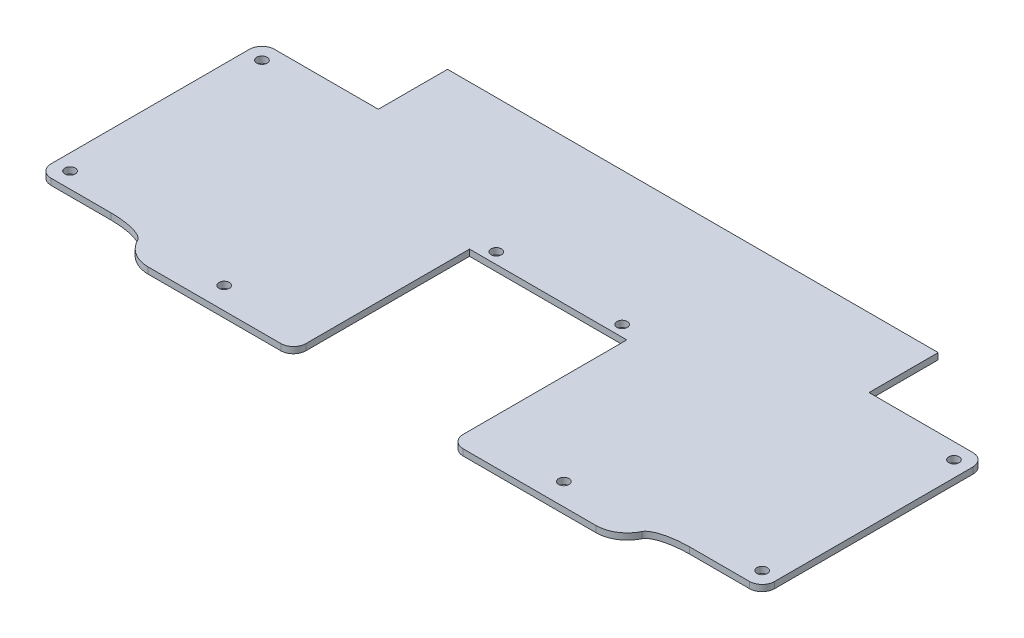
ISO-10303-21;
HEADER;
FILE_DESCRIPTION(('STEP AP214'),'2;1');
FILE_NAME('part.step','',(''),(''),'','','');
FILE_SCHEMA(('AUTOMOTIVE_DESIGN { 1 0 10303 214 1 1 1 1 }'));
ENDSEC;
DATA;
#1=APPLICATION_CONTEXT('core data for automotive mechanical design processes');
#2=APPLICATION_PROTOCOL_DEFINITION('international standard','automotive_design',2000,#1);
#3=PRODUCT_CONTEXT('',#1,'mechanical');
#4=PRODUCT('Part','Part','',(#3));
#5=PRODUCT_RELATED_PRODUCT_CATEGORY('part','',(#4));
#6=PRODUCT_DEFINITION_FORMATION('','',#4);
#7=PRODUCT_DEFINITION_CONTEXT('part definition',#1,'design');
#8=PRODUCT_DEFINITION('design','',#6,#7);
#9=PRODUCT_DEFINITION_SHAPE('','',#8);
#10=(LENGTH_UNIT() NAMED_UNIT(*) SI_UNIT(.MILLI.,.METRE.));
#11=(NAMED_UNIT(*) PLANE_ANGLE_UNIT() SI_UNIT($,.RADIAN.));
#12=(NAMED_UNIT(*) SI_UNIT($,.STERADIAN.) SOLID_ANGLE_UNIT());
#13=UNCERTAINTY_MEASURE_WITH_UNIT(LENGTH_MEASURE(1.E-05),#10,'distance_accuracy_value','');
#14=(GEOMETRIC_REPRESENTATION_CONTEXT(3) GLOBAL_UNCERTAINTY_ASSIGNED_CONTEXT((#13)) GLOBAL_UNIT_ASSIGNED_CONTEXT((#10,
#11,#12)) REPRESENTATION_CONTEXT('',''));
#15=CARTESIAN_POINT('',(0.,0.,0.));
#16=DIRECTION('',(0.,0.,1.));
#17=DIRECTION('',(1.,0.,0.));
#18=AXIS2_PLACEMENT_3D('',#15,#16,#17);
#19=CARTESIAN_POINT('',(0.,2.,0.));
#20=DIRECTION('',(0.,0.,-1.));
#21=DIRECTION('',(-1.,0.,0.));
#22=AXIS2_PLACEMENT_3D('',#19,#20,#21);
#23=PLANE('',#22);
#24=DIRECTION('',(1.,0.,0.));
#25=VECTOR('',#24,1.);
#26=CARTESIAN_POINT('',(0.,2.,0.));
#27=LINE('',#26,#25);
#28=CARTESIAN_POINT('',(43.8448725728949,2.,0.));
#29=VERTEX_POINT('',#28);
#30=CARTESIAN_POINT('',(86.,2.,0.));
#31=VERTEX_POINT('',#30);
#32=EDGE_CURVE('E384',#29,#31,#27,.T.);
#33=ORIENTED_EDGE('',*,*,#32,.F.);
#34=DIRECTION('',(0.,-1.,0.));
#35=VECTOR('',#34,1.);
#36=CARTESIAN_POINT('',(43.8448725728949,2.,0.));
#37=LINE('',#36,#35);
#38=CARTESIAN_POINT('',(43.8448725728949,0.,0.));
#39=VERTEX_POINT('',#38);
#40=EDGE_CURVE('E361',#29,#39,#37,.T.);
#41=ORIENTED_EDGE('',*,*,#40,.T.);
#42=DIRECTION('',(1.,0.,0.));
#43=VECTOR('',#42,1.);
#44=CARTESIAN_POINT('',(0.,0.,0.));
#45=LINE('',#44,#43);
#46=CARTESIAN_POINT('',(86.,0.,0.));
#47=VERTEX_POINT('',#46);
#48=EDGE_CURVE('E404',#39,#47,#45,.T.);
#49=ORIENTED_EDGE('',*,*,#48,.T.);
#50=DIRECTION('',(0.,1.,0.));
#51=VECTOR('',#50,1.);
#52=CARTESIAN_POINT('',(86.,2.,0.));
#53=LINE('',#52,#51);
#54=EDGE_CURVE('E398',#47,#31,#53,.T.);
#55=ORIENTED_EDGE('',*,*,#54,.T.);
#56=EDGE_LOOP('',(#33,#41,#49,#55));
#57=FACE_BOUND('',#56,.T.);
#58=ADVANCED_FACE('F45',(#57),#23,.F.);
#59=CARTESIAN_POINT('',(0.,2.,0.));
#60=DIRECTION('',(1.,0.,0.));
#61=DIRECTION('',(0.,0.,-1.));
#62=AXIS2_PLACEMENT_3D('',#59,#60,#61);
#63=PLANE('',#62);
#64=DIRECTION('',(0.,0.,1.));
#65=VECTOR('',#64,1.);
#66=CARTESIAN_POINT('',(0.,0.,0.));
#67=LINE('',#66,#65);
#68=CARTESIAN_POINT('',(0.,0.,-76.));
#69=VERTEX_POINT('',#68);
#70=CARTESIAN_POINT('',(0.,0.,-13.));
#71=VERTEX_POINT('',#70);
#72=EDGE_CURVE('E399',#69,#71,#67,.T.);
#73=ORIENTED_EDGE('',*,*,#72,.T.);
#74=DIRECTION('',(0.,1.,0.));
#75=VECTOR('',#74,1.);
#76=CARTESIAN_POINT('',(0.,2.,-13.));
#77=LINE('',#76,#75);
#78=CARTESIAN_POINT('',(0.,2.,-13.));
#79=VERTEX_POINT('',#78);
#80=EDGE_CURVE('E454',#71,#79,#77,.T.);
#81=ORIENTED_EDGE('',*,*,#80,.T.);
#82=DIRECTION('',(0.,0.,1.));
#83=VECTOR('',#82,1.);
#84=CARTESIAN_POINT('',(0.,2.,0.));
#85=LINE('',#84,#83);
#86=CARTESIAN_POINT('',(0.,2.,-76.));
#87=VERTEX_POINT('',#86);
#88=EDGE_CURVE('E385',#87,#79,#85,.T.);
#89=ORIENTED_EDGE('',*,*,#88,.F.);
#90=DIRECTION('',(0.,1.,0.));
#91=VECTOR('',#90,1.);
#92=CARTESIAN_POINT('',(0.,2.,-76.));
#93=LINE('',#92,#91);
#94=EDGE_CURVE('E452',#87,#69,#93,.F.);
#95=ORIENTED_EDGE('',*,*,#94,.T.);
#96=EDGE_LOOP('',(#73,#81,#89,#95));
#97=FACE_BOUND('',#96,.T.);
#98=ADVANCED_FACE('F556',(#97),#63,.F.);
#99=CARTESIAN_POINT('',(144.,0.,0.));
#100=VERTEX_POINT('',#99);
#101=CARTESIAN_POINT('',(186.155127427105,0.,0.));
#102=VERTEX_POINT('',#101);
#103=EDGE_CURVE('E380',#100,#102,#45,.T.);
#104=ORIENTED_EDGE('',*,*,#103,.T.);
#105=DIRECTION('',(0.,-1.,0.));
#106=VECTOR('',#105,1.);
#107=CARTESIAN_POINT('',(186.155127427105,2.,0.));
#108=LINE('',#107,#106);
#109=CARTESIAN_POINT('',(186.155127427105,2.,0.));
#110=VERTEX_POINT('',#109);
#111=EDGE_CURVE('E54',#102,#110,#108,.F.);
#112=ORIENTED_EDGE('',*,*,#111,.T.);
#113=CARTESIAN_POINT('',(144.,2.,0.));
#114=VERTEX_POINT('',#113);
#115=EDGE_CURVE('E378',#114,#110,#27,.T.);
#116=ORIENTED_EDGE('',*,*,#115,.F.);
#117=DIRECTION('',(0.,1.,0.));
#118=VECTOR('',#117,1.);
#119=CARTESIAN_POINT('',(144.,2.,0.));
#120=LINE('',#119,#118);
#121=EDGE_CURVE('E440',#114,#100,#120,.F.);
#122=ORIENTED_EDGE('',*,*,#121,.T.);
#123=EDGE_LOOP('',(#104,#112,#116,#122));
#124=FACE_BOUND('',#123,.T.);
#125=ADVANCED_FACE('F377',(#124),#23,.F.);
#126=CARTESIAN_POINT('',(230.,2.,0.));
#127=DIRECTION('',(-1.,0.,0.));
#128=DIRECTION('',(0.,0.,1.));
#129=AXIS2_PLACEMENT_3D('',#126,#127,#128);
#130=PLANE('',#129);
#131=DIRECTION('',(0.,0.,-1.));
#132=VECTOR('',#131,1.);
#133=CARTESIAN_POINT('',(230.,2.,0.));
#134=LINE('',#133,#132);
#135=CARTESIAN_POINT('',(230.,2.,-13.));
#136=VERTEX_POINT('',#135);
#137=CARTESIAN_POINT('',(230.,2.,-76.));
#138=VERTEX_POINT('',#137);
#139=EDGE_CURVE('E387',#136,#138,#134,.T.);
#140=ORIENTED_EDGE('',*,*,#139,.F.);
#141=DIRECTION('',(0.,1.,0.));
#142=VECTOR('',#141,1.);
#143=CARTESIAN_POINT('',(230.,2.,-13.));
#144=LINE('',#143,#142);
#145=CARTESIAN_POINT('',(230.,0.,-13.));
#146=VERTEX_POINT('',#145);
#147=EDGE_CURVE('E448',#136,#146,#144,.F.);
#148=ORIENTED_EDGE('',*,*,#147,.T.);
#149=DIRECTION('',(0.,0.,-1.));
#150=VECTOR('',#149,1.);
#151=CARTESIAN_POINT('',(230.,0.,0.));
#152=LINE('',#151,#150);
#153=CARTESIAN_POINT('',(230.,0.,-76.));
#154=VERTEX_POINT('',#153);
#155=EDGE_CURVE('E405',#146,#154,#152,.T.);
#156=ORIENTED_EDGE('',*,*,#155,.T.);
#157=DIRECTION('',(0.,1.,0.));
#158=VECTOR('',#157,1.);
#159=CARTESIAN_POINT('',(230.,2.,-76.));
#160=LINE('',#159,#158);
#161=EDGE_CURVE('E445',#154,#138,#160,.T.);
#162=ORIENTED_EDGE('',*,*,#161,.T.);
#163=EDGE_LOOP('',(#140,#148,#156,#162));
#164=FACE_BOUND('',#163,.T.);
#165=ADVANCED_FACE('F567',(#164),#130,.F.);
#166=CARTESIAN_POINT('',(0.,2.,-102.));
#167=DIRECTION('',(0.,0.,1.));
#168=DIRECTION('',(1.,0.,0.));
#169=AXIS2_PLACEMENT_3D('',#166,#167,#168);
#170=PLANE('',#169);
#171=DIRECTION('',(-1.,0.,0.));
#172=VECTOR('',#171,1.);
#173=CARTESIAN_POINT('',(0.,2.,-102.));
#174=LINE('',#173,#172);
#175=CARTESIAN_POINT('',(193.,2.,-102.));
#176=VERTEX_POINT('',#175);
#177=CARTESIAN_POINT('',(37.,2.,-102.));
#178=VERTEX_POINT('',#177);
#179=EDGE_CURVE('E395',#176,#178,#174,.T.);
#180=ORIENTED_EDGE('',*,*,#179,.F.);
#181=DIRECTION('',(0.,1.,0.));
#182=VECTOR('',#181,1.);
#183=CARTESIAN_POINT('',(193.,0.,-102.));
#184=LINE('',#183,#182);
#185=CARTESIAN_POINT('',(193.,0.,-102.));
#186=VERTEX_POINT('',#185);
#187=EDGE_CURVE('E687',#186,#176,#184,.T.);
#188=ORIENTED_EDGE('',*,*,#187,.F.);
#189=DIRECTION('',(-1.,0.,0.));
#190=VECTOR('',#189,1.);
#191=CARTESIAN_POINT('',(0.,0.,-102.));
#192=LINE('',#191,#190);
#193=CARTESIAN_POINT('',(37.,0.,-102.));
#194=VERTEX_POINT('',#193);
#195=EDGE_CURVE('E389',#186,#194,#192,.T.);
#196=ORIENTED_EDGE('',*,*,#195,.T.);
#197=DIRECTION('',(0.,1.,0.));
#198=VECTOR('',#197,1.);
#199=CARTESIAN_POINT('',(37.,0.,-102.));
#200=LINE('',#199,#198);
#201=EDGE_CURVE('E402',#194,#178,#200,.T.);
#202=ORIENTED_EDGE('',*,*,#201,.T.);
#203=EDGE_LOOP('',(#180,#188,#196,#202));
#204=FACE_BOUND('',#203,.T.);
#205=ADVANCED_FACE('F303',(#204),#170,.F.);
#206=CARTESIAN_POINT('',(0.,2.,0.));
#207=DIRECTION('',(0.,-1.,0.));
#208=DIRECTION('',(0.,0.,-1.));
#209=AXIS2_PLACEMENT_3D('',#206,#207,#208);
#210=PLANE('',#209);
#211=CARTESIAN_POINT('',(61.,2.,-7.));
#212=DIRECTION('',(0.,-1.,0.));
#213=DIRECTION('',(0.,0.,-1.));
#214=AXIS2_PLACEMENT_3D('',#211,#212,#213);
#215=CIRCLE('',#214,1.65);
#216=CARTESIAN_POINT('',(61.,2.,-8.65));
#217=VERTEX_POINT('',#216);
#218=EDGE_CURVE('E509',#217,#217,#215,.T.);
#219=ORIENTED_EDGE('',*,*,#218,.T.);
#220=EDGE_LOOP('',(#219));
#221=FACE_BOUND('',#220,.T.);
#222=CARTESIAN_POINT('',(169.,2.,-7.00000000000005));
#223=DIRECTION('',(0.,-1.,0.));
#224=DIRECTION('',(0.,0.,-1.));
#225=AXIS2_PLACEMENT_3D('',#222,#223,#224);
#226=CIRCLE('',#225,1.64999999999999);
#227=CARTESIAN_POINT('',(169.,2.,-8.65000000000004));
#228=VERTEX_POINT('',#227);
#229=EDGE_CURVE('E512',#228,#228,#226,.T.);
#230=ORIENTED_EDGE('',*,*,#229,.T.);
#231=EDGE_LOOP('',(#230));
#232=FACE_BOUND('',#231,.T.);
#233=CARTESIAN_POINT('',(5.,2.,-75.));
#234=DIRECTION('',(0.,-1.,0.));
#235=DIRECTION('',(0.,0.,-1.));
#236=AXIS2_PLACEMENT_3D('',#233,#234,#235);
#237=CIRCLE('',#236,1.65);
#238=CARTESIAN_POINT('',(5.,2.,-76.65));
#239=VERTEX_POINT('',#238);
#240=EDGE_CURVE('E242',#239,#239,#237,.T.);
#241=ORIENTED_EDGE('',*,*,#240,.T.);
#242=EDGE_LOOP('',(#241));
#243=FACE_BOUND('',#242,.T.);
#244=CARTESIAN_POINT('',(95.,2.,-59.5));
#245=DIRECTION('',(0.,-1.,0.));
#246=DIRECTION('',(0.,0.,-1.));
#247=AXIS2_PLACEMENT_3D('',#244,#245,#246);
#248=CIRCLE('',#247,1.65);
#249=CARTESIAN_POINT('',(95.,2.,-61.15));
#250=VERTEX_POINT('',#249);
#251=EDGE_CURVE('E476',#250,#250,#248,.T.);
#252=ORIENTED_EDGE('',*,*,#251,.T.);
#253=EDGE_LOOP('',(#252));
#254=FACE_BOUND('',#253,.T.);
#255=CARTESIAN_POINT('',(135.,2.,-59.5));
#256=DIRECTION('',(0.,-1.,0.));
#257=DIRECTION('',(0.,0.,-1.));
#258=AXIS2_PLACEMENT_3D('',#255,#256,#257);
#259=CIRCLE('',#258,1.65000000000002);
#260=CARTESIAN_POINT('',(135.,2.,-61.15));
#261=VERTEX_POINT('',#260);
#262=EDGE_CURVE('E479',#261,#261,#259,.T.);
#263=ORIENTED_EDGE('',*,*,#262,.T.);
#264=EDGE_LOOP('',(#263));
#265=FACE_BOUND('',#264,.T.);
#266=CARTESIAN_POINT('',(225.,2.,-14.0000000000001));
#267=DIRECTION('',(0.,-1.,0.));
#268=DIRECTION('',(0.,0.,-1.));
#269=AXIS2_PLACEMENT_3D('',#266,#267,#268);
#270=CIRCLE('',#269,1.65000000000002);
#271=CARTESIAN_POINT('',(225.,2.,-15.6500000000001));
#272=VERTEX_POINT('',#271);
#273=EDGE_CURVE('E482',#272,#272,#270,.T.);
#274=ORIENTED_EDGE('',*,*,#273,.T.);
#275=EDGE_LOOP('',(#274));
#276=FACE_BOUND('',#275,.T.);
#277=CARTESIAN_POINT('',(225.,2.,-75.0000000000001));
#278=DIRECTION('',(0.,-1.,0.));
#279=DIRECTION('',(0.,0.,-1.));
#280=AXIS2_PLACEMENT_3D('',#277,#278,#279);
#281=CIRCLE('',#280,1.65000000000002);
#282=CARTESIAN_POINT('',(225.,2.,-76.6500000000001));
#283=VERTEX_POINT('',#282);
#284=EDGE_CURVE('E485',#283,#283,#281,.T.);
#285=ORIENTED_EDGE('',*,*,#284,.T.);
#286=EDGE_LOOP('',(#285));
#287=FACE_BOUND('',#286,.T.);
#288=CARTESIAN_POINT('',(5.,2.,-14.));
#289=DIRECTION('',(0.,-1.,0.));
#290=DIRECTION('',(0.,0.,-1.));
#291=AXIS2_PLACEMENT_3D('',#288,#289,#290);
#292=CIRCLE('',#291,1.65);
#293=CARTESIAN_POINT('',(5.,2.,-15.65));
#294=VERTEX_POINT('',#293);
#295=EDGE_CURVE('E488',#294,#294,#292,.T.);
#296=ORIENTED_EDGE('',*,*,#295,.T.);
#297=EDGE_LOOP('',(#296));
#298=FACE_BOUND('',#297,.T.);
#299=CARTESIAN_POINT('',(35.,2.,-5.));
#300=CARTESIAN_POINT('',(35.,2.,-9.));
#301=CARTESIAN_POINT('',(23.,2.,-8.99999999999999));
#302=(BOUNDED_CURVE() B_SPLINE_CURVE(2,(#299,#300,#301),.UNSPECIFIED.,.F.,
.F.) B_SPLINE_CURVE_WITH_KNOTS((3,3),(0.,1.),
.UNSPECIFIED.) CURVE() GEOMETRIC_REPRESENTATION_ITEM() RATIONAL_B_SPLINE_CURVE((1.,
0.707106781186548,1.)) REPRESENTATION_ITEM(''));
#303=CARTESIAN_POINT('',(23.,2.,-9.));
#304=VERTEX_POINT('',#303);
#305=CARTESIAN_POINT('',(34.8470220761661,2.,-5.6383692535883));
#306=VERTEX_POINT('',#305);
#307=EDGE_CURVE('E668',#304,#306,#302,.F.);
#308=ORIENTED_EDGE('',*,*,#307,.T.);
#309=CARTESIAN_POINT('',(43.8448725728949,2.,-10.));
#310=DIRECTION('',(0.,-1.,0.));
#311=DIRECTION('',(0.,0.,-1.));
#312=AXIS2_PLACEMENT_3D('',#309,#310,#311);
#313=CIRCLE('',#312,10.);
#314=EDGE_CURVE('E357',#306,#29,#313,.F.);
#315=ORIENTED_EDGE('',*,*,#314,.T.);
#316=ORIENTED_EDGE('',*,*,#32,.T.);
#317=CARTESIAN_POINT('',(86.,2.,-4.));
#318=DIRECTION('',(0.,-1.,0.));
#319=DIRECTION('',(0.,0.,-1.));
#320=AXIS2_PLACEMENT_3D('',#317,#318,#319);
#321=CIRCLE('',#320,4.);
#322=CARTESIAN_POINT('',(90.,2.,-4.));
#323=VERTEX_POINT('',#322);
#324=EDGE_CURVE('E422',#31,#323,#321,.F.);
#325=ORIENTED_EDGE('',*,*,#324,.T.);
#326=DIRECTION('',(0.,0.,1.));
#327=VECTOR('',#326,1.);
#328=CARTESIAN_POINT('',(90.,2.,0.));
#329=LINE('',#328,#327);
#330=CARTESIAN_POINT('',(90.,2.,-56.));
#331=VERTEX_POINT('',#330);
#332=EDGE_CURVE('E239',#331,#323,#329,.T.);
#333=ORIENTED_EDGE('',*,*,#332,.F.);
#334=DIRECTION('',(-1.,0.,0.));
#335=VECTOR('',#334,1.);
#336=CARTESIAN_POINT('',(90.,2.,-56.));
#337=LINE('',#336,#335);
#338=CARTESIAN_POINT('',(140.,2.,-56.));
#339=VERTEX_POINT('',#338);
#340=EDGE_CURVE('E216',#339,#331,#337,.T.);
#341=ORIENTED_EDGE('',*,*,#340,.F.);
#342=DIRECTION('',(0.,0.,-1.));
#343=VECTOR('',#342,1.);
#344=CARTESIAN_POINT('',(140.,2.,0.));
#345=LINE('',#344,#343);
#346=CARTESIAN_POINT('',(140.,2.,-4.));
#347=VERTEX_POINT('',#346);
#348=EDGE_CURVE('E241',#347,#339,#345,.T.);
#349=ORIENTED_EDGE('',*,*,#348,.F.);
#350=CARTESIAN_POINT('',(144.,2.,-4.));
#351=DIRECTION('',(0.,-1.,0.));
#352=DIRECTION('',(0.,0.,-1.));
#353=AXIS2_PLACEMENT_3D('',#350,#351,#352);
#354=CIRCLE('',#353,4.);
#355=EDGE_CURVE('E383',#347,#114,#354,.F.);
#356=ORIENTED_EDGE('',*,*,#355,.T.);
#357=ORIENTED_EDGE('',*,*,#115,.T.);
#358=CARTESIAN_POINT('',(186.155127427105,2.,-10.));
#359=DIRECTION('',(0.,-1.,0.));
#360=DIRECTION('',(0.,0.,-1.));
#361=AXIS2_PLACEMENT_3D('',#358,#359,#360);
#362=CIRCLE('',#361,10.);
#363=CARTESIAN_POINT('',(195.152965945005,2.,-5.63837544451744));
#364=VERTEX_POINT('',#363);
#365=EDGE_CURVE('E346',#110,#364,#362,.F.);
#366=ORIENTED_EDGE('',*,*,#365,.T.);
#367=CARTESIAN_POINT('',(207.,2.,-8.99999999999999));
#368=CARTESIAN_POINT('',(195.,2.,-9.00000000000008));
#369=CARTESIAN_POINT('',(195.,2.,-5.));
#370=(BOUNDED_CURVE() B_SPLINE_CURVE(2,(#367,#368,#369),.UNSPECIFIED.,.F.,
.F.) B_SPLINE_CURVE_WITH_KNOTS((3,3),(0.,1.),
.UNSPECIFIED.) CURVE() GEOMETRIC_REPRESENTATION_ITEM() RATIONAL_B_SPLINE_CURVE((1.,
0.707106781186545,1.)) REPRESENTATION_ITEM(''));
#371=CARTESIAN_POINT('',(207.,2.,-9.));
#372=VERTEX_POINT('',#371);
#373=EDGE_CURVE('E352',#364,#372,#370,.F.);
#374=ORIENTED_EDGE('',*,*,#373,.T.);
#375=DIRECTION('',(-1.,0.,0.));
#376=VECTOR('',#375,1.);
#377=CARTESIAN_POINT('',(230.,2.,-9.));
#378=LINE('',#377,#376);
#379=CARTESIAN_POINT('',(226.,2.,-9.));
#380=VERTEX_POINT('',#379);
#381=EDGE_CURVE('E220',#380,#372,#378,.T.);
#382=ORIENTED_EDGE('',*,*,#381,.F.);
#383=CARTESIAN_POINT('',(226.,2.,-13.));
#384=DIRECTION('',(0.,-1.,0.));
#385=DIRECTION('',(0.,0.,-1.));
#386=AXIS2_PLACEMENT_3D('',#383,#384,#385);
#387=CIRCLE('',#386,4.);
#388=EDGE_CURVE('E419',#380,#136,#387,.F.);
#389=ORIENTED_EDGE('',*,*,#388,.T.);
#390=ORIENTED_EDGE('',*,*,#139,.T.);
#391=CARTESIAN_POINT('',(226.,2.,-76.));
#392=DIRECTION('',(0.,-1.,0.));
#393=DIRECTION('',(0.,0.,-1.));
#394=AXIS2_PLACEMENT_3D('',#391,#392,#393);
#395=CIRCLE('',#394,4.);
#396=CARTESIAN_POINT('',(226.,2.,-80.));
#397=VERTEX_POINT('',#396);
#398=EDGE_CURVE('E417',#138,#397,#395,.F.);
#399=ORIENTED_EDGE('',*,*,#398,.T.);
#400=DIRECTION('',(1.,0.,0.));
#401=VECTOR('',#400,1.);
#402=CARTESIAN_POINT('',(230.,2.,-80.));
#403=LINE('',#402,#401);
#404=CARTESIAN_POINT('',(193.,2.,-80.));
#405=VERTEX_POINT('',#404);
#406=EDGE_CURVE('E695',#405,#397,#403,.T.);
#407=ORIENTED_EDGE('',*,*,#406,.F.);
#408=DIRECTION('',(0.,0.,1.));
#409=VECTOR('',#408,1.);
#410=CARTESIAN_POINT('',(193.,2.,-102.));
#411=LINE('',#410,#409);
#412=EDGE_CURVE('E468',#176,#405,#411,.T.);
#413=ORIENTED_EDGE('',*,*,#412,.F.);
#414=ORIENTED_EDGE('',*,*,#179,.T.);
#415=DIRECTION('',(0.,0.,-1.));
#416=VECTOR('',#415,1.);
#417=CARTESIAN_POINT('',(37.,2.,-102.));
#418=LINE('',#417,#416);
#419=CARTESIAN_POINT('',(37.,2.,-80.));
#420=VERTEX_POINT('',#419);
#421=EDGE_CURVE('E701',#420,#178,#418,.T.);
#422=ORIENTED_EDGE('',*,*,#421,.F.);
#423=DIRECTION('',(1.,0.,0.));
#424=VECTOR('',#423,1.);
#425=CARTESIAN_POINT('',(0.,2.,-80.));
#426=LINE('',#425,#424);
#427=CARTESIAN_POINT('',(4.,2.,-80.));
#428=VERTEX_POINT('',#427);
#429=EDGE_CURVE('E253',#428,#420,#426,.T.);
#430=ORIENTED_EDGE('',*,*,#429,.F.);
#431=CARTESIAN_POINT('',(4.,2.,-76.));
#432=DIRECTION('',(0.,-1.,0.));
#433=DIRECTION('',(0.,0.,-1.));
#434=AXIS2_PLACEMENT_3D('',#431,#432,#433);
#435=CIRCLE('',#434,4.);
#436=EDGE_CURVE('E412',#428,#87,#435,.F.);
#437=ORIENTED_EDGE('',*,*,#436,.T.);
#438=ORIENTED_EDGE('',*,*,#88,.T.);
#439=CARTESIAN_POINT('',(4.,2.,-13.));
#440=DIRECTION('',(0.,-1.,0.));
#441=DIRECTION('',(0.,0.,-1.));
#442=AXIS2_PLACEMENT_3D('',#439,#440,#441);
#443=CIRCLE('',#442,4.);
#444=CARTESIAN_POINT('',(4.,2.,-9.));
#445=VERTEX_POINT('',#444);
#446=EDGE_CURVE('E414',#79,#445,#443,.F.);
#447=ORIENTED_EDGE('',*,*,#446,.T.);
#448=DIRECTION('',(-1.,0.,0.));
#449=VECTOR('',#448,1.);
#450=CARTESIAN_POINT('',(0.,2.,-9.));
#451=LINE('',#450,#449);
#452=EDGE_CURVE('E254',#304,#445,#451,.T.);
#453=ORIENTED_EDGE('',*,*,#452,.F.);
#454=EDGE_LOOP('',(#308,#315,#316,#325,#333,#341,#349,#356,#357,#366,#374,#382,#389,#390,#399,
#407,#413,#414,#422,#430,#437,#438,#447,#453));
#455=FACE_BOUND('',#454,.T.);
#456=ADVANCED_FACE('F299',(#221,#232,#243,#254,#265,#276,#287,#298,#455),#210,.F.);
#457=CARTESIAN_POINT('',(0.,0.,0.));
#458=DIRECTION('',(0.,-1.,0.));
#459=DIRECTION('',(0.,0.,-1.));
#460=AXIS2_PLACEMENT_3D('',#457,#458,#459);
#461=PLANE('',#460);
#462=CARTESIAN_POINT('',(61.,0.,-7.));
#463=DIRECTION('',(0.,-1.,0.));
#464=DIRECTION('',(0.,0.,-1.));
#465=AXIS2_PLACEMENT_3D('',#462,#463,#464);
#466=CIRCLE('',#465,1.65);
#467=CARTESIAN_POINT('',(61.,0.,-8.65));
#468=VERTEX_POINT('',#467);
#469=EDGE_CURVE('E515',#468,#468,#466,.T.);
#470=ORIENTED_EDGE('',*,*,#469,.F.);
#471=EDGE_LOOP('',(#470));
#472=FACE_BOUND('',#471,.T.);
#473=CARTESIAN_POINT('',(169.,0.,-7.00000000000005));
#474=DIRECTION('',(0.,-1.,0.));
#475=DIRECTION('',(0.,0.,1.));
#476=AXIS2_PLACEMENT_3D('',#473,#474,#475);
#477=CIRCLE('',#476,1.64999999999999);
#478=CARTESIAN_POINT('',(169.,0.,-5.35000000000006));
#479=VERTEX_POINT('',#478);
#480=EDGE_CURVE('E516',#479,#479,#477,.T.);
#481=ORIENTED_EDGE('',*,*,#480,.F.);
#482=EDGE_LOOP('',(#481));
#483=FACE_BOUND('',#482,.T.);
#484=CARTESIAN_POINT('',(5.,0.,-75.));
#485=DIRECTION('',(0.,-1.,0.));
#486=DIRECTION('',(0.,0.,-1.));
#487=AXIS2_PLACEMENT_3D('',#484,#485,#486);
#488=CIRCLE('',#487,1.65);
#489=CARTESIAN_POINT('',(5.,0.,-76.65));
#490=VERTEX_POINT('',#489);
#491=EDGE_CURVE('E494',#490,#490,#488,.T.);
#492=ORIENTED_EDGE('',*,*,#491,.F.);
#493=EDGE_LOOP('',(#492));
#494=FACE_BOUND('',#493,.T.);
#495=CARTESIAN_POINT('',(95.,0.,-59.5));
#496=DIRECTION('',(0.,-1.,0.));
#497=DIRECTION('',(0.,0.,-1.));
#498=AXIS2_PLACEMENT_3D('',#495,#496,#497);
#499=CIRCLE('',#498,1.65);
#500=CARTESIAN_POINT('',(95.,0.,-61.15));
#501=VERTEX_POINT('',#500);
#502=EDGE_CURVE('E502',#501,#501,#499,.T.);
#503=ORIENTED_EDGE('',*,*,#502,.F.);
#504=EDGE_LOOP('',(#503));
#505=FACE_BOUND('',#504,.T.);
#506=CARTESIAN_POINT('',(135.,0.,-59.5));
#507=DIRECTION('',(0.,-1.,0.));
#508=DIRECTION('',(0.,0.,-1.));
#509=AXIS2_PLACEMENT_3D('',#506,#507,#508);
#510=CIRCLE('',#509,1.65000000000002);
#511=CARTESIAN_POINT('',(135.,0.,-61.15));
#512=VERTEX_POINT('',#511);
#513=EDGE_CURVE('E498',#512,#512,#510,.T.);
#514=ORIENTED_EDGE('',*,*,#513,.F.);
#515=EDGE_LOOP('',(#514));
#516=FACE_BOUND('',#515,.T.);
#517=CARTESIAN_POINT('',(225.,0.,-14.0000000000001));
#518=DIRECTION('',(0.,-1.,0.));
#519=DIRECTION('',(0.,0.,1.));
#520=AXIS2_PLACEMENT_3D('',#517,#518,#519);
#521=CIRCLE('',#520,1.65000000000002);
#522=CARTESIAN_POINT('',(225.,0.,-12.3500000000001));
#523=VERTEX_POINT('',#522);
#524=EDGE_CURVE('E495',#523,#523,#521,.T.);
#525=ORIENTED_EDGE('',*,*,#524,.F.);
#526=EDGE_LOOP('',(#525));
#527=FACE_BOUND('',#526,.T.);
#528=CARTESIAN_POINT('',(225.,0.,-75.0000000000001));
#529=DIRECTION('',(0.,-1.,0.));
#530=DIRECTION('',(0.,0.,1.));
#531=AXIS2_PLACEMENT_3D('',#528,#529,#530);
#532=CIRCLE('',#531,1.65000000000002);
#533=CARTESIAN_POINT('',(225.,0.,-73.3500000000001));
#534=VERTEX_POINT('',#533);
#535=EDGE_CURVE('E499',#534,#534,#532,.T.);
#536=ORIENTED_EDGE('',*,*,#535,.F.);
#537=EDGE_LOOP('',(#536));
#538=FACE_BOUND('',#537,.T.);
#539=CARTESIAN_POINT('',(5.,0.,-14.));
#540=DIRECTION('',(0.,-1.,0.));
#541=DIRECTION('',(0.,0.,-1.));
#542=AXIS2_PLACEMENT_3D('',#539,#540,#541);
#543=CIRCLE('',#542,1.65);
#544=CARTESIAN_POINT('',(5.,0.,-15.65));
#545=VERTEX_POINT('',#544);
#546=EDGE_CURVE('E491',#545,#545,#543,.T.);
#547=ORIENTED_EDGE('',*,*,#546,.F.);
#548=EDGE_LOOP('',(#547));
#549=FACE_BOUND('',#548,.T.);
#550=ORIENTED_EDGE('',*,*,#48,.F.);
#551=CARTESIAN_POINT('',(43.8448725728949,0.,-10.));
#552=DIRECTION('',(0.,-1.,0.));
#553=DIRECTION('',(0.,0.,-1.));
#554=AXIS2_PLACEMENT_3D('',#551,#552,#553);
#555=CIRCLE('',#554,10.);
#556=CARTESIAN_POINT('',(34.8470337198352,0.,-5.6383761364759));
#557=VERTEX_POINT('',#556);
#558=EDGE_CURVE('E366',#39,#557,#555,.T.);
#559=ORIENTED_EDGE('',*,*,#558,.T.);
#560=CARTESIAN_POINT('',(23.,0.,-9.));
#561=CARTESIAN_POINT('',(35.,0.,-9.));
#562=CARTESIAN_POINT('',(35.,0.,-5.));
#563=(BOUNDED_CURVE() B_SPLINE_CURVE(2,(#560,#561,#562),.UNSPECIFIED.,.F.,
.F.) B_SPLINE_CURVE_WITH_KNOTS((3,3),(0.,1.),
.UNSPECIFIED.) CURVE() GEOMETRIC_REPRESENTATION_ITEM() RATIONAL_B_SPLINE_CURVE((1.,
0.707106781186548,1.)) REPRESENTATION_ITEM(''));
#564=CARTESIAN_POINT('',(23.,0.,-9.));
#565=VERTEX_POINT('',#564);
#566=EDGE_CURVE('E336',#557,#565,#563,.F.);
#567=ORIENTED_EDGE('',*,*,#566,.T.);
#568=DIRECTION('',(-1.,0.,0.));
#569=VECTOR('',#568,1.);
#570=CARTESIAN_POINT('',(0.,0.,-9.));
#571=LINE('',#570,#569);
#572=CARTESIAN_POINT('',(4.,0.,-9.));
#573=VERTEX_POINT('',#572);
#574=EDGE_CURVE('E250',#565,#573,#571,.T.);
#575=ORIENTED_EDGE('',*,*,#574,.T.);
#576=CARTESIAN_POINT('',(4.,0.,-13.));
#577=DIRECTION('',(0.,-1.,0.));
#578=DIRECTION('',(0.,0.,-1.));
#579=AXIS2_PLACEMENT_3D('',#576,#577,#578);
#580=CIRCLE('',#579,4.);
#581=EDGE_CURVE('E427',#573,#71,#580,.T.);
#582=ORIENTED_EDGE('',*,*,#581,.T.);
#583=ORIENTED_EDGE('',*,*,#72,.F.);
#584=CARTESIAN_POINT('',(4.,0.,-76.));
#585=DIRECTION('',(0.,-1.,0.));
#586=DIRECTION('',(0.,0.,-1.));
#587=AXIS2_PLACEMENT_3D('',#584,#585,#586);
#588=CIRCLE('',#587,4.);
#589=CARTESIAN_POINT('',(4.,0.,-80.));
#590=VERTEX_POINT('',#589);
#591=EDGE_CURVE('E425',#69,#590,#588,.T.);
#592=ORIENTED_EDGE('',*,*,#591,.T.);
#593=DIRECTION('',(1.,0.,0.));
#594=VECTOR('',#593,1.);
#595=CARTESIAN_POINT('',(0.,0.,-80.));
#596=LINE('',#595,#594);
#597=CARTESIAN_POINT('',(37.,0.,-80.));
#598=VERTEX_POINT('',#597);
#599=EDGE_CURVE('E698',#590,#598,#596,.T.);
#600=ORIENTED_EDGE('',*,*,#599,.T.);
#601=DIRECTION('',(0.,0.,-1.));
#602=VECTOR('',#601,1.);
#603=CARTESIAN_POINT('',(37.,0.,-102.));
#604=LINE('',#603,#602);
#605=EDGE_CURVE('E700',#598,#194,#604,.T.);
#606=ORIENTED_EDGE('',*,*,#605,.T.);
#607=ORIENTED_EDGE('',*,*,#195,.F.);
#608=DIRECTION('',(0.,0.,1.));
#609=VECTOR('',#608,1.);
#610=CARTESIAN_POINT('',(193.,0.,-102.));
#611=LINE('',#610,#609);
#612=CARTESIAN_POINT('',(193.,0.,-80.));
#613=VERTEX_POINT('',#612);
#614=EDGE_CURVE('E728',#186,#613,#611,.T.);
#615=ORIENTED_EDGE('',*,*,#614,.T.);
#616=DIRECTION('',(1.,0.,0.));
#617=VECTOR('',#616,1.);
#618=CARTESIAN_POINT('',(230.,0.,-80.));
#619=LINE('',#618,#617);
#620=CARTESIAN_POINT('',(226.,0.,-80.));
#621=VERTEX_POINT('',#620);
#622=EDGE_CURVE('E692',#613,#621,#619,.T.);
#623=ORIENTED_EDGE('',*,*,#622,.T.);
#624=CARTESIAN_POINT('',(226.,0.,-76.));
#625=DIRECTION('',(0.,-1.,0.));
#626=DIRECTION('',(0.,0.,-1.));
#627=AXIS2_PLACEMENT_3D('',#624,#625,#626);
#628=CIRCLE('',#627,4.);
#629=EDGE_CURVE('E429',#621,#154,#628,.T.);
#630=ORIENTED_EDGE('',*,*,#629,.T.);
#631=ORIENTED_EDGE('',*,*,#155,.F.);
#632=CARTESIAN_POINT('',(226.,0.,-13.));
#633=DIRECTION('',(0.,-1.,0.));
#634=DIRECTION('',(0.,0.,-1.));
#635=AXIS2_PLACEMENT_3D('',#632,#633,#634);
#636=CIRCLE('',#635,4.);
#637=CARTESIAN_POINT('',(226.,0.,-9.));
#638=VERTEX_POINT('',#637);
#639=EDGE_CURVE('E431',#146,#638,#636,.T.);
#640=ORIENTED_EDGE('',*,*,#639,.T.);
#641=DIRECTION('',(-1.,0.,0.));
#642=VECTOR('',#641,1.);
#643=CARTESIAN_POINT('',(230.,0.,-9.));
#644=LINE('',#643,#642);
#645=CARTESIAN_POINT('',(207.,0.,-9.));
#646=VERTEX_POINT('',#645);
#647=EDGE_CURVE('E464',#638,#646,#644,.T.);
#648=ORIENTED_EDGE('',*,*,#647,.T.);
#649=CARTESIAN_POINT('',(195.,0.,-5.));
#650=CARTESIAN_POINT('',(195.,0.,-9.00000000000008));
#651=CARTESIAN_POINT('',(207.,0.,-9.));
#652=(BOUNDED_CURVE() B_SPLINE_CURVE(2,(#649,#650,#651),.UNSPECIFIED.,.F.,
.F.) B_SPLINE_CURVE_WITH_KNOTS((3,3),(0.,1.),
.UNSPECIFIED.) CURVE() GEOMETRIC_REPRESENTATION_ITEM() RATIONAL_B_SPLINE_CURVE((1.,
0.707106781186545,1.)) REPRESENTATION_ITEM(''));
#653=CARTESIAN_POINT('',(195.152977923834,0.,-5.63836925358829));
#654=VERTEX_POINT('',#653);
#655=EDGE_CURVE('E684',#646,#654,#652,.F.);
#656=ORIENTED_EDGE('',*,*,#655,.T.);
#657=CARTESIAN_POINT('',(186.155127427105,0.,-10.));
#658=DIRECTION('',(0.,-1.,0.));
#659=DIRECTION('',(0.,0.,-1.));
#660=AXIS2_PLACEMENT_3D('',#657,#658,#659);
#661=CIRCLE('',#660,10.);
#662=EDGE_CURVE('E61',#654,#102,#661,.T.);
#663=ORIENTED_EDGE('',*,*,#662,.T.);
#664=ORIENTED_EDGE('',*,*,#103,.F.);
#665=CARTESIAN_POINT('',(144.,0.,-4.));
#666=DIRECTION('',(0.,-1.,0.));
#667=DIRECTION('',(0.,0.,-1.));
#668=AXIS2_PLACEMENT_3D('',#665,#666,#667);
#669=CIRCLE('',#668,4.);
#670=CARTESIAN_POINT('',(140.,0.,-4.));
#671=VERTEX_POINT('',#670);
#672=EDGE_CURVE('E433',#100,#671,#669,.T.);
#673=ORIENTED_EDGE('',*,*,#672,.T.);
#674=DIRECTION('',(0.,0.,-1.));
#675=VECTOR('',#674,1.);
#676=CARTESIAN_POINT('',(140.,0.,0.));
#677=LINE('',#676,#675);
#678=CARTESIAN_POINT('',(140.,0.,-56.));
#679=VERTEX_POINT('',#678);
#680=EDGE_CURVE('E230',#671,#679,#677,.T.);
#681=ORIENTED_EDGE('',*,*,#680,.T.);
#682=DIRECTION('',(-1.,0.,0.));
#683=VECTOR('',#682,1.);
#684=CARTESIAN_POINT('',(90.,0.,-56.));
#685=LINE('',#684,#683);
#686=CARTESIAN_POINT('',(90.,0.,-56.));
#687=VERTEX_POINT('',#686);
#688=EDGE_CURVE('E213',#679,#687,#685,.T.);
#689=ORIENTED_EDGE('',*,*,#688,.T.);
#690=DIRECTION('',(0.,0.,1.));
#691=VECTOR('',#690,1.);
#692=CARTESIAN_POINT('',(90.,0.,0.));
#693=LINE('',#692,#691);
#694=CARTESIAN_POINT('',(90.,0.,-4.));
#695=VERTEX_POINT('',#694);
#696=EDGE_CURVE('E224',#687,#695,#693,.T.);
#697=ORIENTED_EDGE('',*,*,#696,.T.);
#698=CARTESIAN_POINT('',(86.,0.,-4.));
#699=DIRECTION('',(0.,-1.,0.));
#700=DIRECTION('',(0.,0.,-1.));
#701=AXIS2_PLACEMENT_3D('',#698,#699,#700);
#702=CIRCLE('',#701,4.);
#703=EDGE_CURVE('E435',#695,#47,#702,.T.);
#704=ORIENTED_EDGE('',*,*,#703,.T.);
#705=EDGE_LOOP('',(#550,#559,#567,#575,#582,#583,#592,#600,#606,#607,#615,#623,#630,#631,#640,
#648,#656,#663,#664,#673,#681,#689,#697,#704));
#706=FACE_BOUND('',#705,.T.);
#707=ADVANCED_FACE('F233',(#472,#483,#494,#505,#516,#527,#538,#549,#706),#461,.T.);
#708=CARTESIAN_POINT('',(37.,0.,-102.));
#709=DIRECTION('',(1.,0.,0.));
#710=DIRECTION('',(0.,0.,-1.));
#711=AXIS2_PLACEMENT_3D('',#708,#709,#710);
#712=PLANE('',#711);
#713=ORIENTED_EDGE('',*,*,#421,.T.);
#714=ORIENTED_EDGE('',*,*,#201,.F.);
#715=ORIENTED_EDGE('',*,*,#605,.F.);
#716=DIRECTION('',(0.,1.,0.));
#717=VECTOR('',#716,1.);
#718=CARTESIAN_POINT('',(37.,0.,-80.));
#719=LINE('',#718,#717);
#720=EDGE_CURVE('E704',#598,#420,#719,.T.);
#721=ORIENTED_EDGE('',*,*,#720,.T.);
#722=EDGE_LOOP('',(#713,#714,#715,#721));
#723=FACE_BOUND('',#722,.T.);
#724=ADVANCED_FACE('F292',(#723),#712,.F.);
#725=CARTESIAN_POINT('',(0.,0.,-80.));
#726=DIRECTION('',(0.,0.,1.));
#727=DIRECTION('',(1.,0.,0.));
#728=AXIS2_PLACEMENT_3D('',#725,#726,#727);
#729=PLANE('',#728);
#730=ORIENTED_EDGE('',*,*,#599,.F.);
#731=DIRECTION('',(0.,1.,0.));
#732=VECTOR('',#731,1.);
#733=CARTESIAN_POINT('',(4.,0.,-80.));
#734=LINE('',#733,#732);
#735=EDGE_CURVE('E460',#590,#428,#734,.T.);
#736=ORIENTED_EDGE('',*,*,#735,.T.);
#737=ORIENTED_EDGE('',*,*,#429,.T.);
#738=ORIENTED_EDGE('',*,*,#720,.F.);
#739=EDGE_LOOP('',(#730,#736,#737,#738));
#740=FACE_BOUND('',#739,.T.);
#741=ADVANCED_FACE('F295',(#740),#729,.F.);
#742=CARTESIAN_POINT('',(90.,0.,0.));
#743=DIRECTION('',(-1.,0.,0.));
#744=DIRECTION('',(0.,0.,1.));
#745=AXIS2_PLACEMENT_3D('',#742,#743,#744);
#746=PLANE('',#745);
#747=ORIENTED_EDGE('',*,*,#332,.T.);
#748=DIRECTION('',(0.,1.,0.));
#749=VECTOR('',#748,1.);
#750=CARTESIAN_POINT('',(90.,0.,-4.));
#751=LINE('',#750,#749);
#752=EDGE_CURVE('E227',#323,#695,#751,.F.);
#753=ORIENTED_EDGE('',*,*,#752,.T.);
#754=ORIENTED_EDGE('',*,*,#696,.F.);
#755=DIRECTION('',(0.,1.,0.));
#756=VECTOR('',#755,1.);
#757=CARTESIAN_POINT('',(90.,0.,-56.));
#758=LINE('',#757,#756);
#759=EDGE_CURVE('E208',#687,#331,#758,.T.);
#760=ORIENTED_EDGE('',*,*,#759,.T.);
#761=EDGE_LOOP('',(#747,#753,#754,#760));
#762=FACE_BOUND('',#761,.T.);
#763=ADVANCED_FACE('F225',(#762),#746,.F.);
#764=CARTESIAN_POINT('',(90.,0.,-56.));
#765=DIRECTION('',(0.,0.,-1.));
#766=DIRECTION('',(-1.,0.,0.));
#767=AXIS2_PLACEMENT_3D('',#764,#765,#766);
#768=PLANE('',#767);
#769=ORIENTED_EDGE('',*,*,#340,.T.);
#770=ORIENTED_EDGE('',*,*,#759,.F.);
#771=ORIENTED_EDGE('',*,*,#688,.F.);
#772=DIRECTION('',(0.,1.,0.));
#773=VECTOR('',#772,1.);
#774=CARTESIAN_POINT('',(140.,0.,-56.));
#775=LINE('',#774,#773);
#776=EDGE_CURVE('E221',#679,#339,#775,.T.);
#777=ORIENTED_EDGE('',*,*,#776,.T.);
#778=EDGE_LOOP('',(#769,#770,#771,#777));
#779=FACE_BOUND('',#778,.T.);
#780=ADVANCED_FACE('F210',(#779),#768,.F.);
#781=CARTESIAN_POINT('',(140.,0.,0.));
#782=DIRECTION('',(1.,0.,0.));
#783=DIRECTION('',(0.,0.,-1.));
#784=AXIS2_PLACEMENT_3D('',#781,#782,#783);
#785=PLANE('',#784);
#786=ORIENTED_EDGE('',*,*,#680,.F.);
#787=DIRECTION('',(0.,1.,0.));
#788=VECTOR('',#787,1.);
#789=CARTESIAN_POINT('',(140.,0.,-4.));
#790=LINE('',#789,#788);
#791=EDGE_CURVE('E437',#671,#347,#790,.T.);
#792=ORIENTED_EDGE('',*,*,#791,.T.);
#793=ORIENTED_EDGE('',*,*,#348,.T.);
#794=ORIENTED_EDGE('',*,*,#776,.F.);
#795=EDGE_LOOP('',(#786,#792,#793,#794));
#796=FACE_BOUND('',#795,.T.);
#797=ADVANCED_FACE('F597',(#796),#785,.F.);
#798=CARTESIAN_POINT('',(230.,0.,-9.));
#799=DIRECTION('',(0.,0.,-1.));
#800=DIRECTION('',(-1.,0.,0.));
#801=AXIS2_PLACEMENT_3D('',#798,#799,#800);
#802=PLANE('',#801);
#803=ORIENTED_EDGE('',*,*,#381,.T.);
#804=CARTESIAN_POINT('',(207.,-0.1,-9.));
#805=CARTESIAN_POINT('',(207.,0.633333333333334,-9.));
#806=CARTESIAN_POINT('',(207.,1.36666666666667,-9.));
#807=CARTESIAN_POINT('',(207.,2.1,-9.));
#808=(BOUNDED_CURVE() B_SPLINE_CURVE(3,(#804,#805,#806,#807),.UNSPECIFIED.,.F.,
.F.) B_SPLINE_CURVE_WITH_KNOTS((4,4),(-0.0021,9.99999999999998E-05),
.UNSPECIFIED.) CURVE() GEOMETRIC_REPRESENTATION_ITEM() RATIONAL_B_SPLINE_CURVE((1.,1.,1.,1.)) REPRESENTATION_ITEM(''));
#809=EDGE_CURVE('E463',#372,#646,#808,.F.);
#810=ORIENTED_EDGE('',*,*,#809,.T.);
#811=ORIENTED_EDGE('',*,*,#647,.F.);
#812=DIRECTION('',(0.,1.,0.));
#813=VECTOR('',#812,1.);
#814=CARTESIAN_POINT('',(226.,0.,-9.));
#815=LINE('',#814,#813);
#816=EDGE_CURVE('E442',#638,#380,#815,.T.);
#817=ORIENTED_EDGE('',*,*,#816,.T.);
#818=EDGE_LOOP('',(#803,#810,#811,#817));
#819=FACE_BOUND('',#818,.T.);
#820=ADVANCED_FACE('F287',(#819),#802,.F.);
#821=CARTESIAN_POINT('',(230.,0.,-80.));
#822=DIRECTION('',(0.,0.,1.));
#823=DIRECTION('',(1.,0.,0.));
#824=AXIS2_PLACEMENT_3D('',#821,#822,#823);
#825=PLANE('',#824);
#826=ORIENTED_EDGE('',*,*,#406,.T.);
#827=DIRECTION('',(0.,1.,0.));
#828=VECTOR('',#827,1.);
#829=CARTESIAN_POINT('',(226.,0.,-80.));
#830=LINE('',#829,#828);
#831=EDGE_CURVE('E450',#397,#621,#830,.F.);
#832=ORIENTED_EDGE('',*,*,#831,.T.);
#833=ORIENTED_EDGE('',*,*,#622,.F.);
#834=DIRECTION('',(0.,1.,0.));
#835=VECTOR('',#834,1.);
#836=CARTESIAN_POINT('',(193.,0.,-80.));
#837=LINE('',#836,#835);
#838=EDGE_CURVE('E686',#613,#405,#837,.T.);
#839=ORIENTED_EDGE('',*,*,#838,.T.);
#840=EDGE_LOOP('',(#826,#832,#833,#839));
#841=FACE_BOUND('',#840,.T.);
#842=ADVANCED_FACE('F284',(#841),#825,.F.);
#843=CARTESIAN_POINT('',(193.,0.,-102.));
#844=DIRECTION('',(-1.,0.,0.));
#845=DIRECTION('',(0.,0.,1.));
#846=AXIS2_PLACEMENT_3D('',#843,#844,#845);
#847=PLANE('',#846);
#848=ORIENTED_EDGE('',*,*,#412,.T.);
#849=ORIENTED_EDGE('',*,*,#838,.F.);
#850=ORIENTED_EDGE('',*,*,#614,.F.);
#851=ORIENTED_EDGE('',*,*,#187,.T.);
#852=EDGE_LOOP('',(#848,#849,#850,#851));
#853=FACE_BOUND('',#852,.T.);
#854=ADVANCED_FACE('F282',(#853),#847,.F.);
#855=CARTESIAN_POINT('',(0.,0.,-9.));
#856=DIRECTION('',(0.,0.,-1.));
#857=DIRECTION('',(-1.,0.,0.));
#858=AXIS2_PLACEMENT_3D('',#855,#856,#857);
#859=PLANE('',#858);
#860=ORIENTED_EDGE('',*,*,#574,.F.);
#861=CARTESIAN_POINT('',(23.,2.1,-9.));
#862=CARTESIAN_POINT('',(23.,1.36666666666667,-9.));
#863=CARTESIAN_POINT('',(23.,0.633333333333334,-9.));
#864=CARTESIAN_POINT('',(23.,-0.1,-9.));
#865=(BOUNDED_CURVE() B_SPLINE_CURVE(3,(#861,#862,#863,#864),.UNSPECIFIED.,.F.,
.F.) B_SPLINE_CURVE_WITH_KNOTS((4,4),(-0.0021,0.0001),
.UNSPECIFIED.) CURVE() GEOMETRIC_REPRESENTATION_ITEM() RATIONAL_B_SPLINE_CURVE((1.,1.,1.,1.)) REPRESENTATION_ITEM(''));
#866=EDGE_CURVE('E261',#565,#304,#865,.F.);
#867=ORIENTED_EDGE('',*,*,#866,.T.);
#868=ORIENTED_EDGE('',*,*,#452,.T.);
#869=DIRECTION('',(0.,1.,0.));
#870=VECTOR('',#869,1.);
#871=CARTESIAN_POINT('',(4.,0.,-9.));
#872=LINE('',#871,#870);
#873=EDGE_CURVE('E457',#445,#573,#872,.F.);
#874=ORIENTED_EDGE('',*,*,#873,.T.);
#875=EDGE_LOOP('',(#860,#867,#868,#874));
#876=FACE_BOUND('',#875,.T.);
#877=ADVANCED_FACE('F271',(#876),#859,.F.);
#878=CARTESIAN_POINT('',(5.,10.,-14.));
#879=DIRECTION('',(0.,-1.,0.));
#880=DIRECTION('',(0.,0.,-1.));
#881=AXIS2_PLACEMENT_3D('',#878,#879,#880);
#882=CYLINDRICAL_SURFACE('',#881,1.65);
#883=ORIENTED_EDGE('',*,*,#546,.T.);
#884=EDGE_LOOP('',(#883));
#885=FACE_BOUND('',#884,.T.);
#886=ORIENTED_EDGE('',*,*,#295,.F.);
#887=EDGE_LOOP('',(#886));
#888=FACE_BOUND('',#887,.T.);
#889=ADVANCED_FACE('F281',(#885,#888),#882,.F.);
#890=CARTESIAN_POINT('',(225.,10.,-75.0000000000001));
#891=DIRECTION('',(0.,-1.,0.));
#892=DIRECTION('',(0.,0.,-1.));
#893=AXIS2_PLACEMENT_3D('',#890,#891,#892);
#894=CYLINDRICAL_SURFACE('',#893,1.65000000000002);
#895=ORIENTED_EDGE('',*,*,#535,.T.);
#896=EDGE_LOOP('',(#895));
#897=FACE_BOUND('',#896,.T.);
#898=ORIENTED_EDGE('',*,*,#284,.F.);
#899=EDGE_LOOP('',(#898));
#900=FACE_BOUND('',#899,.T.);
#901=ADVANCED_FACE('F543',(#897,#900),#894,.F.);
#902=CARTESIAN_POINT('',(225.,10.,-14.0000000000001));
#903=DIRECTION('',(0.,-1.,0.));
#904=DIRECTION('',(0.,0.,-1.));
#905=AXIS2_PLACEMENT_3D('',#902,#903,#904);
#906=CYLINDRICAL_SURFACE('',#905,1.65000000000002);
#907=ORIENTED_EDGE('',*,*,#524,.T.);
#908=EDGE_LOOP('',(#907));
#909=FACE_BOUND('',#908,.T.);
#910=ORIENTED_EDGE('',*,*,#273,.F.);
#911=EDGE_LOOP('',(#910));
#912=FACE_BOUND('',#911,.T.);
#913=ADVANCED_FACE('F550',(#909,#912),#906,.F.);
#914=CARTESIAN_POINT('',(135.,10.,-59.5));
#915=DIRECTION('',(0.,-1.,0.));
#916=DIRECTION('',(0.,0.,-1.));
#917=AXIS2_PLACEMENT_3D('',#914,#915,#916);
#918=CYLINDRICAL_SURFACE('',#917,1.65000000000002);
#919=ORIENTED_EDGE('',*,*,#513,.T.);
#920=EDGE_LOOP('',(#919));
#921=FACE_BOUND('',#920,.T.);
#922=ORIENTED_EDGE('',*,*,#262,.F.);
#923=EDGE_LOOP('',(#922));
#924=FACE_BOUND('',#923,.T.);
#925=ADVANCED_FACE('F845',(#921,#924),#918,.F.);
#926=CARTESIAN_POINT('',(95.,10.,-59.5));
#927=DIRECTION('',(0.,-1.,0.));
#928=DIRECTION('',(0.,0.,-1.));
#929=AXIS2_PLACEMENT_3D('',#926,#927,#928);
#930=CYLINDRICAL_SURFACE('',#929,1.65);
#931=ORIENTED_EDGE('',*,*,#502,.T.);
#932=EDGE_LOOP('',(#931));
#933=FACE_BOUND('',#932,.T.);
#934=ORIENTED_EDGE('',*,*,#251,.F.);
#935=EDGE_LOOP('',(#934));
#936=FACE_BOUND('',#935,.T.);
#937=ADVANCED_FACE('F834',(#933,#936),#930,.F.);
#938=CARTESIAN_POINT('',(5.,10.,-75.));
#939=DIRECTION('',(0.,-1.,0.));
#940=DIRECTION('',(0.,0.,-1.));
#941=AXIS2_PLACEMENT_3D('',#938,#939,#940);
#942=CYLINDRICAL_SURFACE('',#941,1.65);
#943=ORIENTED_EDGE('',*,*,#491,.T.);
#944=EDGE_LOOP('',(#943));
#945=FACE_BOUND('',#944,.T.);
#946=ORIENTED_EDGE('',*,*,#240,.F.);
#947=EDGE_LOOP('',(#946));
#948=FACE_BOUND('',#947,.T.);
#949=ADVANCED_FACE('F616',(#945,#948),#942,.F.);
#950=CARTESIAN_POINT('',(86.,2.,-4.));
#951=DIRECTION('',(0.,1.,0.));
#952=DIRECTION('',(0.,0.,1.));
#953=AXIS2_PLACEMENT_3D('',#950,#951,#952);
#954=CYLINDRICAL_SURFACE('',#953,4.);
#955=ORIENTED_EDGE('',*,*,#703,.F.);
#956=ORIENTED_EDGE('',*,*,#752,.F.);
#957=ORIENTED_EDGE('',*,*,#324,.F.);
#958=ORIENTED_EDGE('',*,*,#54,.F.);
#959=EDGE_LOOP('',(#955,#956,#957,#958));
#960=FACE_BOUND('',#959,.T.);
#961=ADVANCED_FACE('F608',(#960),#954,.T.);
#962=CARTESIAN_POINT('',(144.,0.,-4.));
#963=DIRECTION('',(0.,1.,0.));
#964=DIRECTION('',(0.,0.,1.));
#965=AXIS2_PLACEMENT_3D('',#962,#963,#964);
#966=CYLINDRICAL_SURFACE('',#965,4.);
#967=ORIENTED_EDGE('',*,*,#672,.F.);
#968=ORIENTED_EDGE('',*,*,#121,.F.);
#969=ORIENTED_EDGE('',*,*,#355,.F.);
#970=ORIENTED_EDGE('',*,*,#791,.F.);
#971=EDGE_LOOP('',(#967,#968,#969,#970));
#972=FACE_BOUND('',#971,.T.);
#973=ADVANCED_FACE('F606',(#972),#966,.T.);
#974=CARTESIAN_POINT('',(226.,0.,-13.));
#975=DIRECTION('',(0.,1.,0.));
#976=DIRECTION('',(0.,0.,1.));
#977=AXIS2_PLACEMENT_3D('',#974,#975,#976);
#978=CYLINDRICAL_SURFACE('',#977,4.);
#979=ORIENTED_EDGE('',*,*,#639,.F.);
#980=ORIENTED_EDGE('',*,*,#147,.F.);
#981=ORIENTED_EDGE('',*,*,#388,.F.);
#982=ORIENTED_EDGE('',*,*,#816,.F.);
#983=EDGE_LOOP('',(#979,#980,#981,#982));
#984=FACE_BOUND('',#983,.T.);
#985=ADVANCED_FACE('F582',(#984),#978,.T.);
#986=CARTESIAN_POINT('',(226.,2.,-76.));
#987=DIRECTION('',(0.,1.,0.));
#988=DIRECTION('',(0.,0.,1.));
#989=AXIS2_PLACEMENT_3D('',#986,#987,#988);
#990=CYLINDRICAL_SURFACE('',#989,4.);
#991=ORIENTED_EDGE('',*,*,#629,.F.);
#992=ORIENTED_EDGE('',*,*,#831,.F.);
#993=ORIENTED_EDGE('',*,*,#398,.F.);
#994=ORIENTED_EDGE('',*,*,#161,.F.);
#995=EDGE_LOOP('',(#991,#992,#993,#994));
#996=FACE_BOUND('',#995,.T.);
#997=ADVANCED_FACE('F614',(#996),#990,.T.);
#998=CARTESIAN_POINT('',(4.,2.,-13.));
#999=DIRECTION('',(0.,1.,0.));
#1000=DIRECTION('',(0.,0.,1.));
#1001=AXIS2_PLACEMENT_3D('',#998,#999,#1000);
#1002=CYLINDRICAL_SURFACE('',#1001,4.);
#1003=ORIENTED_EDGE('',*,*,#581,.F.);
#1004=ORIENTED_EDGE('',*,*,#873,.F.);
#1005=ORIENTED_EDGE('',*,*,#446,.F.);
#1006=ORIENTED_EDGE('',*,*,#80,.F.);
#1007=EDGE_LOOP('',(#1003,#1004,#1005,#1006));
#1008=FACE_BOUND('',#1007,.T.);
#1009=ADVANCED_FACE('F622',(#1008),#1002,.T.);
#1010=CARTESIAN_POINT('',(4.,0.,-76.));
#1011=DIRECTION('',(0.,1.,0.));
#1012=DIRECTION('',(0.,0.,1.));
#1013=AXIS2_PLACEMENT_3D('',#1010,#1011,#1012);
#1014=CYLINDRICAL_SURFACE('',#1013,4.);
#1015=ORIENTED_EDGE('',*,*,#591,.F.);
#1016=ORIENTED_EDGE('',*,*,#94,.F.);
#1017=ORIENTED_EDGE('',*,*,#436,.F.);
#1018=ORIENTED_EDGE('',*,*,#735,.F.);
#1019=EDGE_LOOP('',(#1015,#1016,#1017,#1018));
#1020=FACE_BOUND('',#1019,.T.);
#1021=ADVANCED_FACE('F626',(#1020),#1014,.T.);
#1022=CARTESIAN_POINT('',(207.,2.1,-9.));
#1023=CARTESIAN_POINT('',(207.,1.36666666666667,-9.));
#1024=CARTESIAN_POINT('',(207.,0.633333333333334,-9.));
#1025=CARTESIAN_POINT('',(207.,-0.1,-9.));
#1026=CARTESIAN_POINT('',(195.,2.1,-9.00000000000008));
#1027=CARTESIAN_POINT('',(195.,1.36666666666667,-9.00000000000008));
#1028=CARTESIAN_POINT('',(195.,0.633333333333334,-9.00000000000008));
#1029=CARTESIAN_POINT('',(195.,-0.1,-9.00000000000008));
#1030=CARTESIAN_POINT('',(195.,2.1,-5.));
#1031=CARTESIAN_POINT('',(195.,1.36666666666667,-5.));
#1032=CARTESIAN_POINT('',(195.,0.633333333333334,-5.));
#1033=CARTESIAN_POINT('',(195.,-0.1,-5.));
#1034=(BOUNDED_SURFACE() B_SPLINE_SURFACE(2,3,((#1022,#1023,#1024,#1025),(#1026,#1027,#1028,
#1029),(#1030,#1031,#1032,#1033)),.UNSPECIFIED.,.F.,.F.,.F.) B_SPLINE_SURFACE_WITH_KNOTS((3,3),
(4,4),(0.,1.),(-0.0021,0.0001),
.UNSPECIFIED.) GEOMETRIC_REPRESENTATION_ITEM() RATIONAL_B_SPLINE_SURFACE(((1.,1.,1.,1.),
(0.707106781186545,0.707106781186545,0.707106781186545,0.707106781186545),(1.,1.,1.,1.))) REPRESENTATION_ITEM('') SURFACE());
#1035=DIRECTION('',(0.,-1.,0.));
#1036=VECTOR('',#1035,1.);
#1037=CARTESIAN_POINT('',(195.153647257195,2.,-5.63804620984235));
#1038=LINE('',#1037,#1036);
#1039=EDGE_CURVE('E12',#364,#654,#1038,.T.);
#1040=ORIENTED_EDGE('',*,*,#373,.F.);
#1041=ORIENTED_EDGE('',*,*,#1039,.T.);
#1042=ORIENTED_EDGE('',*,*,#655,.F.);
#1043=ORIENTED_EDGE('',*,*,#809,.F.);
#1044=EDGE_LOOP('',(#1040,#1041,#1042,#1043));
#1045=FACE_BOUND('',#1044,.T.);
#1046=ADVANCED_FACE('F629',(#1045),#1034,.T.);
#1047=CARTESIAN_POINT('',(35.,2.1,-5.));
#1048=CARTESIAN_POINT('',(35.,1.36666666666667,-5.));
#1049=CARTESIAN_POINT('',(35.,0.633333333333334,-5.));
#1050=CARTESIAN_POINT('',(35.,-0.1,-5.));
#1051=CARTESIAN_POINT('',(35.,2.1,-9.));
#1052=CARTESIAN_POINT('',(35.,1.36666666666667,-9.));
#1053=CARTESIAN_POINT('',(35.,0.633333333333334,-9.));
#1054=CARTESIAN_POINT('',(35.,-0.1,-9.));
#1055=CARTESIAN_POINT('',(23.,2.1,-9.));
#1056=CARTESIAN_POINT('',(23.,1.36666666666667,-9.));
#1057=CARTESIAN_POINT('',(23.,0.633333333333334,-9.));
#1058=CARTESIAN_POINT('',(23.,-0.1,-9.));
#1059=(BOUNDED_SURFACE() B_SPLINE_SURFACE(2,3,((#1047,#1048,#1049,#1050),(#1051,#1052,#1053,
#1054),(#1055,#1056,#1057,#1058)),.UNSPECIFIED.,.F.,.F.,.F.) B_SPLINE_SURFACE_WITH_KNOTS((3,3),
(4,4),(0.,1.),(-0.0021,0.0001),
.UNSPECIFIED.) GEOMETRIC_REPRESENTATION_ITEM() RATIONAL_B_SPLINE_SURFACE(((1.,1.,1.,1.),
(0.707106781186548,0.707106781186548,0.707106781186548,0.707106781186548),(1.,1.,1.,1.))) REPRESENTATION_ITEM('') SURFACE());
#1060=DIRECTION('',(0.,-1.,0.));
#1061=VECTOR('',#1060,1.);
#1062=CARTESIAN_POINT('',(34.8463527428045,0.,-5.63804620984232));
#1063=LINE('',#1062,#1061);
#1064=EDGE_CURVE('E344',#557,#306,#1063,.F.);
#1065=ORIENTED_EDGE('',*,*,#566,.F.);
#1066=ORIENTED_EDGE('',*,*,#1064,.T.);
#1067=ORIENTED_EDGE('',*,*,#307,.F.);
#1068=ORIENTED_EDGE('',*,*,#866,.F.);
#1069=EDGE_LOOP('',(#1065,#1066,#1067,#1068));
#1070=FACE_BOUND('',#1069,.T.);
#1071=ADVANCED_FACE('F639',(#1070),#1059,.T.);
#1072=CARTESIAN_POINT('',(43.8448725728949,1.00000000000001,-10.));
#1073=DIRECTION('',(0.,-1.,0.));
#1074=DIRECTION('',(0.,0.,-1.));
#1075=AXIS2_PLACEMENT_3D('',#1072,#1073,#1074);
#1076=CYLINDRICAL_SURFACE('',#1075,10.);
#1077=ORIENTED_EDGE('',*,*,#558,.F.);
#1078=ORIENTED_EDGE('',*,*,#40,.F.);
#1079=ORIENTED_EDGE('',*,*,#314,.F.);
#1080=ORIENTED_EDGE('',*,*,#1064,.F.);
#1081=EDGE_LOOP('',(#1077,#1078,#1079,#1080));
#1082=FACE_BOUND('',#1081,.T.);
#1083=ADVANCED_FACE('F737',(#1082),#1076,.T.);
#1084=CARTESIAN_POINT('',(186.155127427105,1.0000000000001,-10.));
#1085=DIRECTION('',(0.,-1.,0.));
#1086=DIRECTION('',(0.,0.,-1.));
#1087=AXIS2_PLACEMENT_3D('',#1084,#1085,#1086);
#1088=CYLINDRICAL_SURFACE('',#1087,10.);
#1089=ORIENTED_EDGE('',*,*,#662,.F.);
#1090=ORIENTED_EDGE('',*,*,#1039,.F.);
#1091=ORIENTED_EDGE('',*,*,#365,.F.);
#1092=ORIENTED_EDGE('',*,*,#111,.F.);
#1093=EDGE_LOOP('',(#1089,#1090,#1091,#1092));
#1094=FACE_BOUND('',#1093,.T.);
#1095=ADVANCED_FACE('F47',(#1094),#1088,.T.);
#1096=CARTESIAN_POINT('',(169.,10.,-7.00000000000005));
#1097=DIRECTION('',(0.,-1.,0.));
#1098=DIRECTION('',(0.,0.,-1.));
#1099=AXIS2_PLACEMENT_3D('',#1096,#1097,#1098);
#1100=CYLINDRICAL_SURFACE('',#1099,1.64999999999999);
#1101=ORIENTED_EDGE('',*,*,#480,.T.);
#1102=EDGE_LOOP('',(#1101));
#1103=FACE_BOUND('',#1102,.T.);
#1104=ORIENTED_EDGE('',*,*,#229,.F.);
#1105=EDGE_LOOP('',(#1104));
#1106=FACE_BOUND('',#1105,.T.);
#1107=ADVANCED_FACE('F743',(#1103,#1106),#1100,.F.);
#1108=CARTESIAN_POINT('',(61.,10.,-7.));
#1109=DIRECTION('',(0.,-1.,0.));
#1110=DIRECTION('',(0.,0.,-1.));
#1111=AXIS2_PLACEMENT_3D('',#1108,#1109,#1110);
#1112=CYLINDRICAL_SURFACE('',#1111,1.65);
#1113=ORIENTED_EDGE('',*,*,#469,.T.);
#1114=EDGE_LOOP('',(#1113));
#1115=FACE_BOUND('',#1114,.T.);
#1116=ORIENTED_EDGE('',*,*,#218,.F.);
#1117=EDGE_LOOP('',(#1116));
#1118=FACE_BOUND('',#1117,.T.);
#1119=ADVANCED_FACE('F522',(#1115,#1118),#1112,.F.);
#1120=CLOSED_SHELL('',(#58,#98,#125,#165,#205,#456,#707,#724,#741,#763,#780,#797,#820,#842,#854,
#877,#889,#901,#913,#925,#937,#949,#961,#973,#985,#997,#1009,#1021,#1046,#1071,#1083,#1095,
#1107,#1119));
#1121=MANIFOLD_SOLID_BREP('B2',#1120);
#1122=ADVANCED_BREP_SHAPE_REPRESENTATION('',(#18,#1121),#14);
#1123=SHAPE_DEFINITION_REPRESENTATION(#9,#1122);
ENDSEC;
END-ISO-10303-21;
